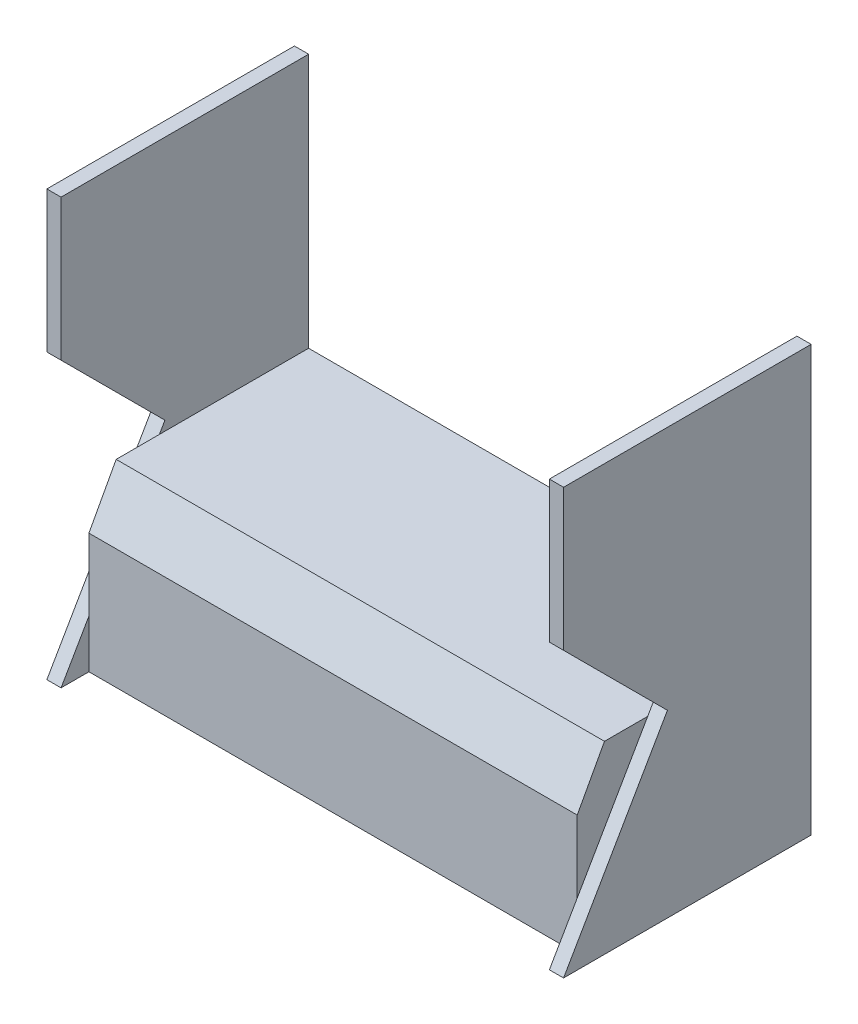
ISO-10303-21;
HEADER;
FILE_DESCRIPTION(('STEP AP214'),'2;1');
FILE_NAME('part.step','',(''),(''),'','','');
FILE_SCHEMA(('AUTOMOTIVE_DESIGN { 1 0 10303 214 1 1 1 1 }'));
ENDSEC;
DATA;
#1=APPLICATION_CONTEXT('core data for automotive mechanical design processes');
#2=APPLICATION_PROTOCOL_DEFINITION('international standard','automotive_design',2000,#1);
#3=PRODUCT_CONTEXT('',#1,'mechanical');
#4=PRODUCT('Part','Part','',(#3));
#5=PRODUCT_RELATED_PRODUCT_CATEGORY('part','',(#4));
#6=PRODUCT_DEFINITION_FORMATION('','',#4);
#7=PRODUCT_DEFINITION_CONTEXT('part definition',#1,'design');
#8=PRODUCT_DEFINITION('design','',#6,#7);
#9=PRODUCT_DEFINITION_SHAPE('','',#8);
#10=(LENGTH_UNIT() NAMED_UNIT(*) SI_UNIT(.MILLI.,.METRE.));
#11=(NAMED_UNIT(*) PLANE_ANGLE_UNIT() SI_UNIT($,.RADIAN.));
#12=(NAMED_UNIT(*) SI_UNIT($,.STERADIAN.) SOLID_ANGLE_UNIT());
#13=UNCERTAINTY_MEASURE_WITH_UNIT(LENGTH_MEASURE(1.E-05),#10,'distance_accuracy_value','');
#14=(GEOMETRIC_REPRESENTATION_CONTEXT(3) GLOBAL_UNCERTAINTY_ASSIGNED_CONTEXT((#13)) GLOBAL_UNIT_ASSIGNED_CONTEXT((#10,
#11,#12)) REPRESENTATION_CONTEXT('',''));
#15=CARTESIAN_POINT('',(0.,0.,0.));
#16=DIRECTION('',(0.,0.,1.));
#17=DIRECTION('',(1.,0.,0.));
#18=AXIS2_PLACEMENT_3D('',#15,#16,#17);
#19=CARTESIAN_POINT('',(50.,0.,0.));
#20=DIRECTION('',(-1.,0.,0.));
#21=DIRECTION('',(0.,0.,1.));
#22=AXIS2_PLACEMENT_3D('',#19,#20,#21);
#23=PLANE('',#22);
#24=DIRECTION('',(0.,-1.,0.));
#25=VECTOR('',#24,1.);
#26=CARTESIAN_POINT('',(50.,0.,-872.));
#27=LINE('',#26,#25);
#28=CARTESIAN_POINT('',(50.,1497.,-872.));
#29=VERTEX_POINT('',#28);
#30=CARTESIAN_POINT('',(49.9999999999998,600.,-872.));
#31=VERTEX_POINT('',#30);
#32=EDGE_CURVE('E261',#29,#31,#27,.T.);
#33=ORIENTED_EDGE('',*,*,#32,.F.);
#34=DIRECTION('',(0.,0.,1.));
#35=VECTOR('',#34,1.);
#36=CARTESIAN_POINT('',(50.,1497.,0.));
#37=LINE('',#36,#35);
#38=CARTESIAN_POINT('',(50.,1497.,0.));
#39=VERTEX_POINT('',#38);
#40=EDGE_CURVE('E172',#29,#39,#37,.T.);
#41=ORIENTED_EDGE('',*,*,#40,.T.);
#42=DIRECTION('',(0.,-1.,0.));
#43=VECTOR('',#42,1.);
#44=CARTESIAN_POINT('',(50.,999.517352344465,0.));
#45=LINE('',#44,#43);
#46=CARTESIAN_POINT('',(50.,999.517352344465,0.));
#47=VERTEX_POINT('',#46);
#48=EDGE_CURVE('E304',#39,#47,#45,.T.);
#49=ORIENTED_EDGE('',*,*,#48,.T.);
#50=DIRECTION('',(0.,-0.707106781186546,-0.707106781186549));
#51=VECTOR('',#50,1.);
#52=CARTESIAN_POINT('',(50.,633.668609863028,-365.848742481439));
#53=LINE('',#52,#51);
#54=CARTESIAN_POINT('',(50.,633.668609863028,-365.848742481439));
#55=VERTEX_POINT('',#54);
#56=EDGE_CURVE('E306',#47,#55,#53,.T.);
#57=ORIENTED_EDGE('',*,*,#56,.T.);
#58=DIRECTION('',(0.,-0.866025403784436,0.500000000000004));
#59=VECTOR('',#58,1.);
#60=CARTESIAN_POINT('',(50.,0.,0.));
#61=LINE('',#60,#59);
#62=CARTESIAN_POINT('',(50.,600.,-346.410161513779));
#63=VERTEX_POINT('',#62);
#64=EDGE_CURVE('E195',#55,#63,#61,.T.);
#65=ORIENTED_EDGE('',*,*,#64,.T.);
#66=DIRECTION('',(0.,0.,1.));
#67=VECTOR('',#66,1.);
#68=CARTESIAN_POINT('',(50.,600.,-1722.));
#69=LINE('',#68,#67);
#70=EDGE_CURVE('E220',#31,#63,#69,.T.);
#71=ORIENTED_EDGE('',*,*,#70,.F.);
#72=EDGE_LOOP('',(#33,#41,#49,#57,#65,#71));
#73=FACE_BOUND('',#72,.T.);
#74=ADVANCED_FACE('F37',(#73),#23,.F.);
#75=CARTESIAN_POINT('',(50.,0.,-1722.));
#76=DIRECTION('',(0.,1.,0.));
#77=DIRECTION('',(0.,0.,1.));
#78=AXIS2_PLACEMENT_3D('',#75,#76,#77);
#79=PLANE('',#78);
#80=DIRECTION('',(-1.,0.,0.));
#81=VECTOR('',#80,1.);
#82=CARTESIAN_POINT('',(0.,0.,-872.));
#83=LINE('',#82,#81);
#84=CARTESIAN_POINT('',(1820.,0.,-872.));
#85=VERTEX_POINT('',#84);
#86=CARTESIAN_POINT('',(0.,0.,-872.));
#87=VERTEX_POINT('',#86);
#88=EDGE_CURVE('E159',#85,#87,#83,.T.);
#89=ORIENTED_EDGE('',*,*,#88,.F.);
#90=DIRECTION('',(0.,0.,1.));
#91=VECTOR('',#90,1.);
#92=CARTESIAN_POINT('',(1820.,0.,0.));
#93=LINE('',#92,#91);
#94=CARTESIAN_POINT('',(1820.,0.,0.));
#95=VERTEX_POINT('',#94);
#96=EDGE_CURVE('E270',#85,#95,#93,.T.);
#97=ORIENTED_EDGE('',*,*,#96,.T.);
#98=DIRECTION('',(-1.,0.,0.));
#99=VECTOR('',#98,1.);
#100=CARTESIAN_POINT('',(1820.,0.,0.));
#101=LINE('',#100,#99);
#102=CARTESIAN_POINT('',(1770.,0.,0.));
#103=VERTEX_POINT('',#102);
#104=EDGE_CURVE('E240',#95,#103,#101,.T.);
#105=ORIENTED_EDGE('',*,*,#104,.T.);
#106=DIRECTION('',(0.,0.,1.));
#107=VECTOR('',#106,1.);
#108=CARTESIAN_POINT('',(1770.,0.,0.));
#109=LINE('',#108,#107);
#110=CARTESIAN_POINT('',(1770.,0.,-98.1242175209889));
#111=VERTEX_POINT('',#110);
#112=EDGE_CURVE('E256',#111,#103,#109,.T.);
#113=ORIENTED_EDGE('',*,*,#112,.F.);
#114=DIRECTION('',(-1.,0.,0.));
#115=VECTOR('',#114,1.);
#116=CARTESIAN_POINT('',(1770.,0.,-98.1242175209889));
#117=LINE('',#116,#115);
#118=CARTESIAN_POINT('',(50.,0.,-98.1242175209889));
#119=VERTEX_POINT('',#118);
#120=EDGE_CURVE('E294',#111,#119,#117,.T.);
#121=ORIENTED_EDGE('',*,*,#120,.T.);
#122=DIRECTION('',(0.,0.,-1.));
#123=VECTOR('',#122,1.);
#124=CARTESIAN_POINT('',(50.,0.,-1722.));
#125=LINE('',#124,#123);
#126=CARTESIAN_POINT('',(50.,0.,0.));
#127=VERTEX_POINT('',#126);
#128=EDGE_CURVE('E190',#127,#119,#125,.T.);
#129=ORIENTED_EDGE('',*,*,#128,.F.);
#130=DIRECTION('',(-1.,0.,0.));
#131=VECTOR('',#130,1.);
#132=CARTESIAN_POINT('',(50.,0.,0.));
#133=LINE('',#132,#131);
#134=CARTESIAN_POINT('',(0.,0.,0.));
#135=VERTEX_POINT('',#134);
#136=EDGE_CURVE('E191',#127,#135,#133,.T.);
#137=ORIENTED_EDGE('',*,*,#136,.T.);
#138=DIRECTION('',(0.,0.,-1.));
#139=VECTOR('',#138,1.);
#140=CARTESIAN_POINT('',(0.,0.,-1722.));
#141=LINE('',#140,#139);
#142=EDGE_CURVE('E179',#135,#87,#141,.T.);
#143=ORIENTED_EDGE('',*,*,#142,.T.);
#144=EDGE_LOOP('',(#89,#97,#105,#113,#121,#129,#137,#143));
#145=FACE_BOUND('',#144,.T.);
#146=ADVANCED_FACE('F39',(#145),#79,.F.);
#147=CARTESIAN_POINT('',(50.,1497.,0.));
#148=DIRECTION('',(0.,-1.,0.));
#149=DIRECTION('',(0.,0.,-1.));
#150=AXIS2_PLACEMENT_3D('',#147,#148,#149);
#151=PLANE('',#150);
#152=DIRECTION('',(1.,0.,0.));
#153=VECTOR('',#152,1.);
#154=CARTESIAN_POINT('',(0.,1497.,-872.));
#155=LINE('',#154,#153);
#156=CARTESIAN_POINT('',(0.,1497.,-872.));
#157=VERTEX_POINT('',#156);
#158=EDGE_CURVE('E156',#157,#29,#155,.T.);
#159=ORIENTED_EDGE('',*,*,#158,.F.);
#160=DIRECTION('',(0.,0.,1.));
#161=VECTOR('',#160,1.);
#162=CARTESIAN_POINT('',(0.,1497.,0.));
#163=LINE('',#162,#161);
#164=CARTESIAN_POINT('',(0.,1497.,0.));
#165=VERTEX_POINT('',#164);
#166=EDGE_CURVE('E170',#157,#165,#163,.T.);
#167=ORIENTED_EDGE('',*,*,#166,.T.);
#168=DIRECTION('',(-1.,0.,0.));
#169=VECTOR('',#168,1.);
#170=CARTESIAN_POINT('',(50.,1497.,0.));
#171=LINE('',#170,#169);
#172=EDGE_CURVE('E200',#39,#165,#171,.T.);
#173=ORIENTED_EDGE('',*,*,#172,.F.);
#174=ORIENTED_EDGE('',*,*,#40,.F.);
#175=EDGE_LOOP('',(#159,#167,#173,#174));
#176=FACE_BOUND('',#175,.T.);
#177=ADVANCED_FACE('F168',(#176),#151,.F.);
#178=CARTESIAN_POINT('',(0.,0.,0.));
#179=DIRECTION('',(-1.,0.,0.));
#180=DIRECTION('',(0.,0.,1.));
#181=AXIS2_PLACEMENT_3D('',#178,#179,#180);
#182=PLANE('',#181);
#183=ORIENTED_EDGE('',*,*,#166,.F.);
#184=DIRECTION('',(0.,1.,0.));
#185=VECTOR('',#184,1.);
#186=CARTESIAN_POINT('',(0.,0.,-872.));
#187=LINE('',#186,#185);
#188=EDGE_CURVE('E153',#87,#157,#187,.T.);
#189=ORIENTED_EDGE('',*,*,#188,.F.);
#190=ORIENTED_EDGE('',*,*,#142,.F.);
#191=DIRECTION('',(0.,-0.866025403784436,0.500000000000004));
#192=VECTOR('',#191,1.);
#193=CARTESIAN_POINT('',(0.,0.,0.));
#194=LINE('',#193,#192);
#195=CARTESIAN_POINT('',(0.,633.668609863028,-365.848742481439));
#196=VERTEX_POINT('',#195);
#197=EDGE_CURVE('E188',#196,#135,#194,.T.);
#198=ORIENTED_EDGE('',*,*,#197,.F.);
#199=DIRECTION('',(0.,-0.707106781186546,-0.707106781186549));
#200=VECTOR('',#199,1.);
#201=CARTESIAN_POINT('',(0.,633.668609863028,-365.848742481439));
#202=LINE('',#201,#200);
#203=CARTESIAN_POINT('',(0.,999.517352344465,0.));
#204=VERTEX_POINT('',#203);
#205=EDGE_CURVE('E181',#204,#196,#202,.T.);
#206=ORIENTED_EDGE('',*,*,#205,.F.);
#207=DIRECTION('',(0.,-1.,0.));
#208=VECTOR('',#207,1.);
#209=CARTESIAN_POINT('',(0.,999.517352344465,0.));
#210=LINE('',#209,#208);
#211=EDGE_CURVE('E178',#165,#204,#210,.T.);
#212=ORIENTED_EDGE('',*,*,#211,.F.);
#213=EDGE_LOOP('',(#183,#189,#190,#198,#206,#212));
#214=FACE_BOUND('',#213,.T.);
#215=ADVANCED_FACE('F176',(#214),#182,.T.);
#216=CARTESIAN_POINT('',(1770.,600.,-1722.));
#217=DIRECTION('',(0.,-1.,0.));
#218=DIRECTION('',(0.,0.,-1.));
#219=AXIS2_PLACEMENT_3D('',#216,#217,#218);
#220=PLANE('',#219);
#221=DIRECTION('',(1.,0.,0.));
#222=VECTOR('',#221,1.);
#223=CARTESIAN_POINT('',(1770.,600.,-872.));
#224=LINE('',#223,#222);
#225=CARTESIAN_POINT('',(1770.,600.,-872.));
#226=VERTEX_POINT('',#225);
#227=EDGE_CURVE('E52',#31,#226,#224,.T.);
#228=ORIENTED_EDGE('',*,*,#227,.F.);
#229=ORIENTED_EDGE('',*,*,#70,.T.);
#230=CARTESIAN_POINT('',(50.,600.,-194.068411451529));
#231=VERTEX_POINT('',#230);
#232=EDGE_CURVE('E217',#63,#231,#69,.T.);
#233=ORIENTED_EDGE('',*,*,#232,.T.);
#234=DIRECTION('',(-1.,0.,0.));
#235=VECTOR('',#234,1.);
#236=CARTESIAN_POINT('',(1770.,600.,-194.068411451529));
#237=LINE('',#236,#235);
#238=CARTESIAN_POINT('',(1770.,600.,-194.068411451529));
#239=VERTEX_POINT('',#238);
#240=EDGE_CURVE('E231',#239,#231,#237,.T.);
#241=ORIENTED_EDGE('',*,*,#240,.F.);
#242=DIRECTION('',(0.,0.,1.));
#243=VECTOR('',#242,1.);
#244=CARTESIAN_POINT('',(1770.,600.,-1722.));
#245=LINE('',#244,#243);
#246=CARTESIAN_POINT('',(1770.,600.,-346.410161513779));
#247=VERTEX_POINT('',#246);
#248=EDGE_CURVE('E232',#247,#239,#245,.T.);
#249=ORIENTED_EDGE('',*,*,#248,.F.);
#250=EDGE_CURVE('E58',#226,#247,#245,.T.);
#251=ORIENTED_EDGE('',*,*,#250,.F.);
#252=EDGE_LOOP('',(#228,#229,#233,#241,#249,#251));
#253=FACE_BOUND('',#252,.T.);
#254=ADVANCED_FACE('F332',(#253),#220,.F.);
#255=CARTESIAN_POINT('',(1820.,1497.,0.));
#256=DIRECTION('',(0.,1.,0.));
#257=DIRECTION('',(0.,0.,1.));
#258=AXIS2_PLACEMENT_3D('',#255,#256,#257);
#259=PLANE('',#258);
#260=DIRECTION('',(0.,0.,-1.));
#261=VECTOR('',#260,1.);
#262=CARTESIAN_POINT('',(1820.,1497.,0.));
#263=LINE('',#262,#261);
#264=CARTESIAN_POINT('',(1820.,1497.,0.));
#265=VERTEX_POINT('',#264);
#266=CARTESIAN_POINT('',(1820.,1497.,-872.));
#267=VERTEX_POINT('',#266);
#268=EDGE_CURVE('E251',#265,#267,#263,.T.);
#269=ORIENTED_EDGE('',*,*,#268,.T.);
#270=CARTESIAN_POINT('',(1770.,1497.,-872.));
#271=VERTEX_POINT('',#270);
#272=EDGE_CURVE('E164',#271,#267,#155,.T.);
#273=ORIENTED_EDGE('',*,*,#272,.F.);
#274=DIRECTION('',(0.,0.,-1.));
#275=VECTOR('',#274,1.);
#276=CARTESIAN_POINT('',(1770.,1497.,0.));
#277=LINE('',#276,#275);
#278=CARTESIAN_POINT('',(1770.,1497.,0.));
#279=VERTEX_POINT('',#278);
#280=EDGE_CURVE('E258',#279,#271,#277,.T.);
#281=ORIENTED_EDGE('',*,*,#280,.F.);
#282=DIRECTION('',(-1.,0.,0.));
#283=VECTOR('',#282,1.);
#284=CARTESIAN_POINT('',(1820.,1497.,0.));
#285=LINE('',#284,#283);
#286=EDGE_CURVE('E222',#265,#279,#285,.T.);
#287=ORIENTED_EDGE('',*,*,#286,.F.);
#288=EDGE_LOOP('',(#269,#273,#281,#287));
#289=FACE_BOUND('',#288,.T.);
#290=ADVANCED_FACE('F369',(#289),#259,.T.);
#291=CARTESIAN_POINT('',(1820.,0.,0.));
#292=DIRECTION('',(-1.,0.,0.));
#293=DIRECTION('',(0.,0.,1.));
#294=AXIS2_PLACEMENT_3D('',#291,#292,#293);
#295=PLANE('',#294);
#296=DIRECTION('',(0.,-1.,0.));
#297=VECTOR('',#296,1.);
#298=CARTESIAN_POINT('',(1820.,0.,-872.));
#299=LINE('',#298,#297);
#300=EDGE_CURVE('E173',#267,#85,#299,.T.);
#301=ORIENTED_EDGE('',*,*,#300,.F.);
#302=ORIENTED_EDGE('',*,*,#268,.F.);
#303=DIRECTION('',(0.,1.,0.));
#304=VECTOR('',#303,1.);
#305=CARTESIAN_POINT('',(1820.,0.,0.));
#306=LINE('',#305,#304);
#307=CARTESIAN_POINT('',(1820.,999.517352344465,0.));
#308=VERTEX_POINT('',#307);
#309=EDGE_CURVE('E244',#308,#265,#306,.T.);
#310=ORIENTED_EDGE('',*,*,#309,.F.);
#311=DIRECTION('',(0.,0.707106781186546,0.707106781186549));
#312=VECTOR('',#311,1.);
#313=CARTESIAN_POINT('',(1820.,499.758676172234,-499.758676172233));
#314=LINE('',#313,#312);
#315=CARTESIAN_POINT('',(1820.,633.668609863028,-365.848742481439));
#316=VERTEX_POINT('',#315);
#317=EDGE_CURVE('E264',#316,#308,#314,.T.);
#318=ORIENTED_EDGE('',*,*,#317,.F.);
#319=DIRECTION('',(0.,0.866025403784436,-0.500000000000004));
#320=VECTOR('',#319,1.);
#321=CARTESIAN_POINT('',(1820.,0.,0.));
#322=LINE('',#321,#320);
#323=EDGE_CURVE('E267',#95,#316,#322,.T.);
#324=ORIENTED_EDGE('',*,*,#323,.F.);
#325=ORIENTED_EDGE('',*,*,#96,.F.);
#326=EDGE_LOOP('',(#301,#302,#310,#318,#324,#325));
#327=FACE_BOUND('',#326,.T.);
#328=ADVANCED_FACE('F285',(#327),#295,.F.);
#329=CARTESIAN_POINT('',(1770.,0.,0.));
#330=DIRECTION('',(-1.,0.,0.));
#331=DIRECTION('',(0.,0.,1.));
#332=AXIS2_PLACEMENT_3D('',#329,#330,#331);
#333=PLANE('',#332);
#334=ORIENTED_EDGE('',*,*,#280,.T.);
#335=DIRECTION('',(0.,-1.,0.));
#336=VECTOR('',#335,1.);
#337=CARTESIAN_POINT('',(1770.,0.,-872.));
#338=LINE('',#337,#336);
#339=EDGE_CURVE('E11',#271,#226,#338,.T.);
#340=ORIENTED_EDGE('',*,*,#339,.T.);
#341=ORIENTED_EDGE('',*,*,#250,.T.);
#342=DIRECTION('',(0.,0.866025403784436,-0.500000000000004));
#343=VECTOR('',#342,1.);
#344=CARTESIAN_POINT('',(1770.,0.,0.));
#345=LINE('',#344,#343);
#346=CARTESIAN_POINT('',(1770.,633.668609863028,-365.848742481439));
#347=VERTEX_POINT('',#346);
#348=EDGE_CURVE('E214',#247,#347,#345,.T.);
#349=ORIENTED_EDGE('',*,*,#348,.T.);
#350=DIRECTION('',(0.,0.707106781186546,0.707106781186549));
#351=VECTOR('',#350,1.);
#352=CARTESIAN_POINT('',(1770.,499.758676172234,-499.758676172233));
#353=LINE('',#352,#351);
#354=CARTESIAN_POINT('',(1770.,999.517352344465,0.));
#355=VERTEX_POINT('',#354);
#356=EDGE_CURVE('E252',#347,#355,#353,.T.);
#357=ORIENTED_EDGE('',*,*,#356,.T.);
#358=DIRECTION('',(0.,1.,0.));
#359=VECTOR('',#358,1.);
#360=CARTESIAN_POINT('',(1770.,0.,0.));
#361=LINE('',#360,#359);
#362=EDGE_CURVE('E248',#355,#279,#361,.T.);
#363=ORIENTED_EDGE('',*,*,#362,.T.);
#364=EDGE_LOOP('',(#334,#340,#341,#349,#357,#363));
#365=FACE_BOUND('',#364,.T.);
#366=ADVANCED_FACE('F377',(#365),#333,.T.);
#367=CARTESIAN_POINT('',(1770.,0.,0.));
#368=DIRECTION('',(1.,0.,0.));
#369=DIRECTION('',(0.,0.,-1.));
#370=AXIS2_PLACEMENT_3D('',#367,#368,#369);
#371=PLANE('',#370);
#372=DIRECTION('',(0.,-1.,0.));
#373=VECTOR('',#372,1.);
#374=CARTESIAN_POINT('',(1770.,423.,-98.1242175209889));
#375=LINE('',#374,#373);
#376=CARTESIAN_POINT('',(1770.,423.,-98.1242175209889));
#377=VERTEX_POINT('',#376);
#378=CARTESIAN_POINT('',(1770.,169.956130199291,-98.124217520989));
#379=VERTEX_POINT('',#378);
#380=EDGE_CURVE('E233',#377,#379,#375,.T.);
#381=ORIENTED_EDGE('',*,*,#380,.T.);
#382=EDGE_CURVE('E45',#379,#247,#345,.T.);
#383=ORIENTED_EDGE('',*,*,#382,.T.);
#384=ORIENTED_EDGE('',*,*,#248,.T.);
#385=DIRECTION('',(0.,-0.879147995153898,0.476548845992604));
#386=VECTOR('',#385,1.);
#387=CARTESIAN_POINT('',(1770.,600.,-194.068411451529));
#388=LINE('',#387,#386);
#389=EDGE_CURVE('E237',#239,#377,#388,.T.);
#390=ORIENTED_EDGE('',*,*,#389,.T.);
#391=EDGE_LOOP('',(#381,#383,#384,#390));
#392=FACE_BOUND('',#391,.T.);
#393=ADVANCED_FACE('F337',(#392),#371,.T.);
#394=DIRECTION('',(0.,-1.,0.));
#395=VECTOR('',#394,1.);
#396=CARTESIAN_POINT('',(50.,423.,-98.1242175209889));
#397=LINE('',#396,#395);
#398=CARTESIAN_POINT('',(50.,169.956130199292,-98.124217520989));
#399=VERTEX_POINT('',#398);
#400=EDGE_CURVE('E201',#399,#119,#397,.T.);
#401=ORIENTED_EDGE('',*,*,#400,.F.);
#402=EDGE_CURVE('E307',#399,#127,#61,.T.);
#403=ORIENTED_EDGE('',*,*,#402,.T.);
#404=ORIENTED_EDGE('',*,*,#128,.T.);
#405=EDGE_LOOP('',(#401,#403,#404));
#406=FACE_BOUND('',#405,.T.);
#407=ADVANCED_FACE('F318',(#406),#23,.F.);
#408=CARTESIAN_POINT('',(50.,999.517352344465,0.));
#409=DIRECTION('',(0.,0.,-1.));
#410=DIRECTION('',(-1.,0.,0.));
#411=AXIS2_PLACEMENT_3D('',#408,#409,#410);
#412=PLANE('',#411);
#413=ORIENTED_EDGE('',*,*,#211,.T.);
#414=DIRECTION('',(-1.,0.,0.));
#415=VECTOR('',#414,1.);
#416=CARTESIAN_POINT('',(50.,999.517352344465,0.));
#417=LINE('',#416,#415);
#418=EDGE_CURVE('E198',#47,#204,#417,.T.);
#419=ORIENTED_EDGE('',*,*,#418,.F.);
#420=ORIENTED_EDGE('',*,*,#48,.F.);
#421=ORIENTED_EDGE('',*,*,#172,.T.);
#422=EDGE_LOOP('',(#413,#419,#420,#421));
#423=FACE_BOUND('',#422,.T.);
#424=ADVANCED_FACE('F338',(#423),#412,.F.);
#425=CARTESIAN_POINT('',(50.,633.668609863028,-365.848742481439));
#426=DIRECTION('',(0.,0.707106781186549,-0.707106781186546));
#427=DIRECTION('',(0.,0.707106781186546,0.707106781186549));
#428=AXIS2_PLACEMENT_3D('',#425,#426,#427);
#429=PLANE('',#428);
#430=ORIENTED_EDGE('',*,*,#205,.T.);
#431=DIRECTION('',(-1.,0.,0.));
#432=VECTOR('',#431,1.);
#433=CARTESIAN_POINT('',(50.,633.668609863028,-365.848742481439));
#434=LINE('',#433,#432);
#435=EDGE_CURVE('E194',#55,#196,#434,.T.);
#436=ORIENTED_EDGE('',*,*,#435,.F.);
#437=ORIENTED_EDGE('',*,*,#56,.F.);
#438=ORIENTED_EDGE('',*,*,#418,.T.);
#439=EDGE_LOOP('',(#430,#436,#437,#438));
#440=FACE_BOUND('',#439,.T.);
#441=ADVANCED_FACE('F325',(#440),#429,.F.);
#442=CARTESIAN_POINT('',(50.,0.,0.));
#443=DIRECTION('',(0.,-0.500000000000004,-0.866025403784436));
#444=DIRECTION('',(0.,0.866025403784437,-0.500000000000004));
#445=AXIS2_PLACEMENT_3D('',#442,#443,#444);
#446=PLANE('',#445);
#447=ORIENTED_EDGE('',*,*,#197,.T.);
#448=ORIENTED_EDGE('',*,*,#136,.F.);
#449=ORIENTED_EDGE('',*,*,#402,.F.);
#450=EDGE_CURVE('E309',#63,#399,#61,.T.);
#451=ORIENTED_EDGE('',*,*,#450,.F.);
#452=ORIENTED_EDGE('',*,*,#64,.F.);
#453=ORIENTED_EDGE('',*,*,#435,.T.);
#454=EDGE_LOOP('',(#447,#448,#449,#451,#452,#453));
#455=FACE_BOUND('',#454,.T.);
#456=ADVANCED_FACE('F321',(#455),#446,.F.);
#457=CARTESIAN_POINT('',(50.,0.,0.));
#458=DIRECTION('',(1.,0.,0.));
#459=DIRECTION('',(0.,0.,-1.));
#460=AXIS2_PLACEMENT_3D('',#457,#458,#459);
#461=PLANE('',#460);
#462=ORIENTED_EDGE('',*,*,#232,.F.);
#463=ORIENTED_EDGE('',*,*,#450,.T.);
#464=CARTESIAN_POINT('',(50.,423.,-98.1242175209889));
#465=VERTEX_POINT('',#464);
#466=EDGE_CURVE('E206',#465,#399,#397,.T.);
#467=ORIENTED_EDGE('',*,*,#466,.F.);
#468=DIRECTION('',(0.,-0.879147995153898,0.476548845992604));
#469=VECTOR('',#468,1.);
#470=CARTESIAN_POINT('',(50.,600.,-194.068411451529));
#471=LINE('',#470,#469);
#472=EDGE_CURVE('E218',#231,#465,#471,.T.);
#473=ORIENTED_EDGE('',*,*,#472,.F.);
#474=EDGE_LOOP('',(#462,#463,#467,#473));
#475=FACE_BOUND('',#474,.T.);
#476=ADVANCED_FACE('F329',(#475),#461,.F.);
#477=CARTESIAN_POINT('',(1770.,600.,-194.068411451529));
#478=DIRECTION('',(0.,-0.476548845992604,-0.879147995153898));
#479=DIRECTION('',(0.,0.879147995153898,-0.476548845992604));
#480=AXIS2_PLACEMENT_3D('',#477,#478,#479);
#481=PLANE('',#480);
#482=ORIENTED_EDGE('',*,*,#472,.T.);
#483=DIRECTION('',(-1.,0.,0.));
#484=VECTOR('',#483,1.);
#485=CARTESIAN_POINT('',(1770.,423.,-98.1242175209889));
#486=LINE('',#485,#484);
#487=EDGE_CURVE('E183',#377,#465,#486,.T.);
#488=ORIENTED_EDGE('',*,*,#487,.F.);
#489=ORIENTED_EDGE('',*,*,#389,.F.);
#490=ORIENTED_EDGE('',*,*,#240,.T.);
#491=EDGE_LOOP('',(#482,#488,#489,#490));
#492=FACE_BOUND('',#491,.T.);
#493=ADVANCED_FACE('F335',(#492),#481,.F.);
#494=CARTESIAN_POINT('',(1770.,423.,-98.1242175209889));
#495=DIRECTION('',(0.,0.,-1.));
#496=DIRECTION('',(0.,1.,0.));
#497=AXIS2_PLACEMENT_3D('',#494,#495,#496);
#498=PLANE('',#497);
#499=ORIENTED_EDGE('',*,*,#466,.T.);
#500=ORIENTED_EDGE('',*,*,#400,.T.);
#501=ORIENTED_EDGE('',*,*,#120,.F.);
#502=EDGE_CURVE('E236',#379,#111,#375,.T.);
#503=ORIENTED_EDGE('',*,*,#502,.F.);
#504=ORIENTED_EDGE('',*,*,#380,.F.);
#505=ORIENTED_EDGE('',*,*,#487,.T.);
#506=EDGE_LOOP('',(#499,#500,#501,#503,#504,#505));
#507=FACE_BOUND('',#506,.T.);
#508=ADVANCED_FACE('F297',(#507),#498,.F.);
#509=EDGE_CURVE('E213',#103,#379,#345,.T.);
#510=ORIENTED_EDGE('',*,*,#509,.T.);
#511=ORIENTED_EDGE('',*,*,#502,.T.);
#512=ORIENTED_EDGE('',*,*,#112,.T.);
#513=EDGE_LOOP('',(#510,#511,#512));
#514=FACE_BOUND('',#513,.T.);
#515=ADVANCED_FACE('F371',(#514),#333,.T.);
#516=CARTESIAN_POINT('',(1820.,0.,0.));
#517=DIRECTION('',(0.,0.,1.));
#518=DIRECTION('',(1.,0.,0.));
#519=AXIS2_PLACEMENT_3D('',#516,#517,#518);
#520=PLANE('',#519);
#521=ORIENTED_EDGE('',*,*,#362,.F.);
#522=DIRECTION('',(-1.,0.,0.));
#523=VECTOR('',#522,1.);
#524=CARTESIAN_POINT('',(1820.,999.517352344465,0.));
#525=LINE('',#524,#523);
#526=EDGE_CURVE('E227',#308,#355,#525,.T.);
#527=ORIENTED_EDGE('',*,*,#526,.F.);
#528=ORIENTED_EDGE('',*,*,#309,.T.);
#529=ORIENTED_EDGE('',*,*,#286,.T.);
#530=EDGE_LOOP('',(#521,#527,#528,#529));
#531=FACE_BOUND('',#530,.T.);
#532=ADVANCED_FACE('F375',(#531),#520,.T.);
#533=CARTESIAN_POINT('',(1820.,499.758676172234,-499.758676172233));
#534=DIRECTION('',(0.,-0.707106781186549,0.707106781186546));
#535=DIRECTION('',(0.,-0.707106781186546,-0.707106781186549));
#536=AXIS2_PLACEMENT_3D('',#533,#534,#535);
#537=PLANE('',#536);
#538=ORIENTED_EDGE('',*,*,#356,.F.);
#539=DIRECTION('',(-1.,0.,0.));
#540=VECTOR('',#539,1.);
#541=CARTESIAN_POINT('',(1820.,633.668609863028,-365.848742481439));
#542=LINE('',#541,#540);
#543=EDGE_CURVE('E243',#316,#347,#542,.T.);
#544=ORIENTED_EDGE('',*,*,#543,.F.);
#545=ORIENTED_EDGE('',*,*,#317,.T.);
#546=ORIENTED_EDGE('',*,*,#526,.T.);
#547=EDGE_LOOP('',(#538,#544,#545,#546));
#548=FACE_BOUND('',#547,.T.);
#549=ADVANCED_FACE('F381',(#548),#537,.T.);
#550=CARTESIAN_POINT('',(1820.,0.,0.));
#551=DIRECTION('',(0.,0.500000000000004,0.866025403784436));
#552=DIRECTION('',(0.,-0.866025403784437,0.500000000000004));
#553=AXIS2_PLACEMENT_3D('',#550,#551,#552);
#554=PLANE('',#553);
#555=ORIENTED_EDGE('',*,*,#509,.F.);
#556=ORIENTED_EDGE('',*,*,#104,.F.);
#557=ORIENTED_EDGE('',*,*,#323,.T.);
#558=ORIENTED_EDGE('',*,*,#543,.T.);
#559=ORIENTED_EDGE('',*,*,#348,.F.);
#560=ORIENTED_EDGE('',*,*,#382,.F.);
#561=EDGE_LOOP('',(#555,#556,#557,#558,#559,#560));
#562=FACE_BOUND('',#561,.T.);
#563=ADVANCED_FACE('F290',(#562),#554,.T.);
#564=CARTESIAN_POINT('',(0.,0.,-872.));
#565=DIRECTION('',(0.,0.,-1.));
#566=DIRECTION('',(-1.,0.,0.));
#567=AXIS2_PLACEMENT_3D('',#564,#565,#566);
#568=PLANE('',#567);
#569=ORIENTED_EDGE('',*,*,#32,.T.);
#570=ORIENTED_EDGE('',*,*,#227,.T.);
#571=ORIENTED_EDGE('',*,*,#339,.F.);
#572=ORIENTED_EDGE('',*,*,#272,.T.);
#573=ORIENTED_EDGE('',*,*,#300,.T.);
#574=ORIENTED_EDGE('',*,*,#88,.T.);
#575=ORIENTED_EDGE('',*,*,#188,.T.);
#576=ORIENTED_EDGE('',*,*,#158,.T.);
#577=EDGE_LOOP('',(#569,#570,#571,#572,#573,#574,#575,#576));
#578=FACE_BOUND('',#577,.T.);
#579=ADVANCED_FACE('F155',(#578),#568,.T.);
#580=CLOSED_SHELL('',(#74,#146,#177,#215,#254,#290,#328,#366,#393,#407,#424,#441,#456,#476,#493,
#508,#515,#532,#549,#563,#579));
#581=MANIFOLD_SOLID_BREP('B2',#580);
#582=ADVANCED_BREP_SHAPE_REPRESENTATION('',(#18,#581),#14);
#583=SHAPE_DEFINITION_REPRESENTATION(#9,#582);
ENDSEC;
END-ISO-10303-21;
